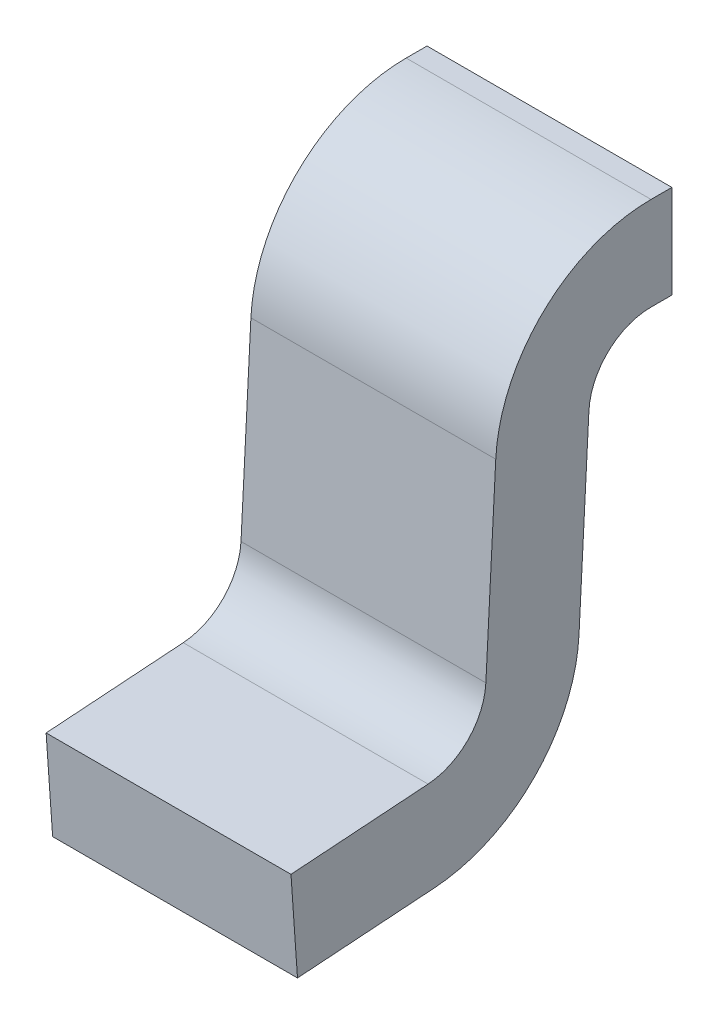
ISO-10303-21;
HEADER;
FILE_DESCRIPTION(('STEP AP214'),'2;1');
FILE_NAME('part.step','',(''),(''),'','','');
FILE_SCHEMA(('AUTOMOTIVE_DESIGN { 1 0 10303 214 1 1 1 1 }'));
ENDSEC;
DATA;
#1=APPLICATION_CONTEXT('core data for automotive mechanical design processes');
#2=APPLICATION_PROTOCOL_DEFINITION('international standard','automotive_design',2000,#1);
#3=PRODUCT_CONTEXT('',#1,'mechanical');
#4=PRODUCT('Part','Part','',(#3));
#5=PRODUCT_RELATED_PRODUCT_CATEGORY('part','',(#4));
#6=PRODUCT_DEFINITION_FORMATION('','',#4);
#7=PRODUCT_DEFINITION_CONTEXT('part definition',#1,'design');
#8=PRODUCT_DEFINITION('design','',#6,#7);
#9=PRODUCT_DEFINITION_SHAPE('','',#8);
#10=(LENGTH_UNIT() NAMED_UNIT(*) SI_UNIT(.MILLI.,.METRE.));
#11=(NAMED_UNIT(*) PLANE_ANGLE_UNIT() SI_UNIT($,.RADIAN.));
#12=(NAMED_UNIT(*) SI_UNIT($,.STERADIAN.) SOLID_ANGLE_UNIT());
#13=UNCERTAINTY_MEASURE_WITH_UNIT(LENGTH_MEASURE(1.E-05),#10,'distance_accuracy_value','');
#14=(GEOMETRIC_REPRESENTATION_CONTEXT(3) GLOBAL_UNCERTAINTY_ASSIGNED_CONTEXT((#13)) GLOBAL_UNIT_ASSIGNED_CONTEXT((#10,
#11,#12)) REPRESENTATION_CONTEXT('',''));
#15=CARTESIAN_POINT('',(0.,0.,0.));
#16=DIRECTION('',(0.,0.,1.));
#17=DIRECTION('',(1.,0.,0.));
#18=AXIS2_PLACEMENT_3D('',#15,#16,#17);
#19=CARTESIAN_POINT('',(0.200025,0.,0.));
#20=DIRECTION('',(1.,0.,0.));
#21=DIRECTION('',(0.,0.,-1.));
#22=AXIS2_PLACEMENT_3D('',#19,#20,#21);
#23=PLANE('',#22);
#24=CARTESIAN_POINT('',(0.200025,0.3556,-0.120375636666));
#25=DIRECTION('',(-1.,0.,0.));
#26=DIRECTION('',(0.,0.,1.));
#27=AXIS2_PLACEMENT_3D('',#24,#25,#26);
#28=CIRCLE('',#27,0.254);
#29=CARTESIAN_POINT('',(0.200025,0.368893332885866,0.133276265161628));
#30=VERTEX_POINT('',#29);
#31=CARTESIAN_POINT('',(0.200025,0.6096,-0.120375636666));
#32=VERTEX_POINT('',#31);
#33=EDGE_CURVE('E196',#30,#32,#28,.T.);
#34=ORIENTED_EDGE('',*,*,#33,.F.);
#35=DIRECTION('',(0.,-0.998629534754575,0.0523359562429177));
#36=VECTOR('',#35,1.);
#37=CARTESIAN_POINT('',(0.200025,0.007975999731426,0.152191141097));
#38=LINE('',#37,#36);
#39=CARTESIAN_POINT('',(0.200025,0.060528969879516,0.149436956636373));
#40=VERTEX_POINT('',#39);
#41=EDGE_CURVE('E193',#40,#30,#38,.F.);
#42=ORIENTED_EDGE('',*,*,#41,.F.);
#43=CARTESIAN_POINT('',(0.200025,0.06584630303378,0.250897717367));
#44=DIRECTION('',(1.,0.,0.));
#45=DIRECTION('',(0.,0.,-1.));
#46=AXIS2_PLACEMENT_3D('',#43,#44,#45);
#47=CIRCLE('',#46,0.1016);
#48=CARTESIAN_POINT('',(0.200025,-0.0355062044726014,0.2438104596348));
#49=VERTEX_POINT('',#48);
#50=EDGE_CURVE('E190',#40,#49,#47,.F.);
#51=ORIENTED_EDGE('',*,*,#50,.T.);
#52=DIRECTION('',(0.,-0.0697564737441177,0.997564050259825));
#53=VECTOR('',#52,1.);
#54=CARTESIAN_POINT('',(0.200025,-0.02923592850034,0.154141335618));
#55=LINE('',#54,#53);
#56=CARTESIAN_POINT('',(0.200025,-0.0511712387403868,0.467830886598001));
#57=VERTEX_POINT('',#56);
#58=EDGE_CURVE('E186',#57,#49,#55,.F.);
#59=ORIENTED_EDGE('',*,*,#58,.F.);
#60=DIRECTION('',(0.,-0.997564050259825,-0.0697564737441177));
#61=VECTOR('',#60,1.);
#62=CARTESIAN_POINT('',(0.200025,-0.0511712387404,0.467830886598));
#63=LINE('',#62,#61);
#64=CARTESIAN_POINT('',(0.200025,-0.203199999999986,0.4571999999998));
#65=VERTEX_POINT('',#64);
#66=EDGE_CURVE('E126',#65,#57,#63,.F.);
#67=ORIENTED_EDGE('',*,*,#66,.F.);
#68=DIRECTION('',(0.,0.0697564737441177,-0.997564050259825));
#69=VECTOR('',#68,1.);
#70=CARTESIAN_POINT('',(0.200025,-0.2032,0.4572));
#71=LINE('',#70,#69);
#72=CARTESIAN_POINT('',(0.200025,-0.1875349657322,0.233179573035991));
#73=VERTEX_POINT('',#72);
#74=EDGE_CURVE('E130',#73,#65,#71,.F.);
#75=ORIENTED_EDGE('',*,*,#74,.F.);
#76=CARTESIAN_POINT('',(0.200025,0.06584630303378,0.250897717367));
#77=DIRECTION('',(-1.,0.,0.));
#78=DIRECTION('',(0.,0.,1.));
#79=AXIS2_PLACEMENT_3D('',#76,#77,#78);
#80=CIRCLE('',#79,0.254);
#81=CARTESIAN_POINT('',(0.200025,0.052552970148079,-0.00275418446043526));
#82=VERTEX_POINT('',#81);
#83=EDGE_CURVE('E174',#82,#73,#80,.T.);
#84=ORIENTED_EDGE('',*,*,#83,.F.);
#85=DIRECTION('',(0.,0.998629534754575,-0.0523359562429177));
#86=VECTOR('',#85,1.);
#87=CARTESIAN_POINT('',(0.200025,-0.171859275802,0.009006762993949));
#88=LINE('',#87,#86);
#89=CARTESIAN_POINT('',(0.200025,0.36091733315414,-0.0189148759351527));
#90=VERTEX_POINT('',#89);
#91=EDGE_CURVE('E90',#90,#82,#88,.F.);
#92=ORIENTED_EDGE('',*,*,#91,.F.);
#93=CARTESIAN_POINT('',(0.200025,0.3556,-0.120375636666));
#94=DIRECTION('',(1.,0.,0.));
#95=DIRECTION('',(0.,0.,-1.));
#96=AXIS2_PLACEMENT_3D('',#93,#94,#95);
#97=CIRCLE('',#96,0.1016);
#98=CARTESIAN_POINT('',(0.200025,0.4572,-0.120375636666));
#99=VERTEX_POINT('',#98);
#100=EDGE_CURVE('E20',#90,#99,#97,.F.);
#101=ORIENTED_EDGE('',*,*,#100,.T.);
#102=DIRECTION('',(0.,0.,-1.));
#103=VECTOR('',#102,1.);
#104=CARTESIAN_POINT('',(0.200025,0.4572,-0.02396083668821));
#105=LINE('',#104,#103);
#106=CARTESIAN_POINT('',(0.200025,0.4572,-0.154469113401));
#107=VERTEX_POINT('',#106);
#108=EDGE_CURVE('E96',#107,#99,#105,.F.);
#109=ORIENTED_EDGE('',*,*,#108,.F.);
#110=DIRECTION('',(0.,1.,0.));
#111=VECTOR('',#110,1.);
#112=CARTESIAN_POINT('',(0.200025,0.4572,-0.154469113401));
#113=LINE('',#112,#111);
#114=CARTESIAN_POINT('',(0.200025,0.6096,-0.154469113401));
#115=VERTEX_POINT('',#114);
#116=EDGE_CURVE('E102',#115,#107,#113,.F.);
#117=ORIENTED_EDGE('',*,*,#116,.F.);
#118=DIRECTION('',(0.,0.,1.));
#119=VECTOR('',#118,1.);
#120=CARTESIAN_POINT('',(0.200025,0.6096,-0.154469113401));
#121=LINE('',#120,#119);
#122=EDGE_CURVE('E108',#32,#115,#121,.F.);
#123=ORIENTED_EDGE('',*,*,#122,.F.);
#124=EDGE_LOOP('',(#34,#42,#51,#59,#67,#75,#84,#92,#101,#109,#117,#123));
#125=FACE_BOUND('',#124,.T.);
#126=ADVANCED_FACE('F17',(#125),#23,.T.);
#127=CARTESIAN_POINT('',(-0.200025,-0.171859275802,0.009006762993949));
#128=DIRECTION('',(0.,-0.0523359562429177,-0.998629534754575));
#129=DIRECTION('',(0.,0.998629534754575,-0.0523359562429177));
#130=AXIS2_PLACEMENT_3D('',#127,#128,#129);
#131=PLANE('',#130);
#132=DIRECTION('',(1.,0.,0.));
#133=VECTOR('',#132,1.);
#134=CARTESIAN_POINT('',(-0.200025,0.360917333154023,-0.0189148759349217));
#135=LINE('',#134,#133);
#136=CARTESIAN_POINT('',(-0.200025,0.360917333154144,-0.0189148759351528));
#137=VERTEX_POINT('',#136);
#138=EDGE_CURVE('E211',#137,#90,#135,.T.);
#139=ORIENTED_EDGE('',*,*,#138,.T.);
#140=ORIENTED_EDGE('',*,*,#91,.T.);
#141=DIRECTION('',(-1.,0.,0.));
#142=VECTOR('',#141,1.);
#143=CARTESIAN_POINT('',(-0.200025,0.0525529701480553,-0.00275418446066082));
#144=LINE('',#143,#142);
#145=CARTESIAN_POINT('',(-0.200025,0.0525529701480712,-0.0027541844604246));
#146=VERTEX_POINT('',#145);
#147=EDGE_CURVE('E172',#146,#82,#144,.F.);
#148=ORIENTED_EDGE('',*,*,#147,.F.);
#149=DIRECTION('',(0.,0.998629534754572,-0.0523359562429831));
#150=VECTOR('',#149,1.);
#151=CARTESIAN_POINT('',(-0.200025,0.05255297014808,-0.002754184460188));
#152=LINE('',#151,#150);
#153=EDGE_CURVE('E169',#146,#137,#152,.T.);
#154=ORIENTED_EDGE('',*,*,#153,.T.);
#155=EDGE_LOOP('',(#139,#140,#148,#154));
#156=FACE_BOUND('',#155,.T.);
#157=ADVANCED_FACE('F257',(#156),#131,.T.);
#158=CARTESIAN_POINT('',(-0.200025,0.3556,-0.120375636666));
#159=DIRECTION('',(1.,0.,0.));
#160=DIRECTION('',(0.,0.,-1.));
#161=AXIS2_PLACEMENT_3D('',#158,#159,#160);
#162=CYLINDRICAL_SURFACE('',#161,0.1016);
#163=ORIENTED_EDGE('',*,*,#138,.F.);
#164=CARTESIAN_POINT('',(-0.200025,0.3556,-0.120375636666));
#165=DIRECTION('',(1.,0.,0.));
#166=DIRECTION('',(0.,0.,-1.));
#167=AXIS2_PLACEMENT_3D('',#164,#165,#166);
#168=CIRCLE('',#167,0.1016);
#169=CARTESIAN_POINT('',(-0.200025,0.4572,-0.120375636666));
#170=VERTEX_POINT('',#169);
#171=EDGE_CURVE('E166',#137,#170,#168,.F.);
#172=ORIENTED_EDGE('',*,*,#171,.T.);
#173=DIRECTION('',(1.,0.,0.));
#174=VECTOR('',#173,1.);
#175=CARTESIAN_POINT('',(-0.200025,0.4572,-0.120375636666));
#176=LINE('',#175,#174);
#177=EDGE_CURVE('E209',#99,#170,#176,.F.);
#178=ORIENTED_EDGE('',*,*,#177,.F.);
#179=ORIENTED_EDGE('',*,*,#100,.F.);
#180=EDGE_LOOP('',(#163,#172,#178,#179));
#181=FACE_BOUND('',#180,.T.);
#182=ADVANCED_FACE('F255',(#181),#162,.F.);
#183=CARTESIAN_POINT('',(-0.200025,0.4572,-0.02396083668821));
#184=DIRECTION('',(0.,-1.,0.));
#185=DIRECTION('',(0.,0.,-1.));
#186=AXIS2_PLACEMENT_3D('',#183,#184,#185);
#187=PLANE('',#186);
#188=ORIENTED_EDGE('',*,*,#177,.T.);
#189=DIRECTION('',(0.,0.,-1.));
#190=VECTOR('',#189,1.);
#191=CARTESIAN_POINT('',(-0.200025,0.4572,0.));
#192=LINE('',#191,#190);
#193=CARTESIAN_POINT('',(-0.200025,0.4572,-0.154469113401));
#194=VERTEX_POINT('',#193);
#195=EDGE_CURVE('E163',#170,#194,#192,.T.);
#196=ORIENTED_EDGE('',*,*,#195,.T.);
#197=DIRECTION('',(-1.,0.,0.));
#198=VECTOR('',#197,1.);
#199=CARTESIAN_POINT('',(-0.200025,0.4572,-0.154469113401));
#200=LINE('',#199,#198);
#201=EDGE_CURVE('E205',#107,#194,#200,.T.);
#202=ORIENTED_EDGE('',*,*,#201,.F.);
#203=ORIENTED_EDGE('',*,*,#108,.T.);
#204=EDGE_LOOP('',(#188,#196,#202,#203));
#205=FACE_BOUND('',#204,.T.);
#206=ADVANCED_FACE('F251',(#205),#187,.T.);
#207=CARTESIAN_POINT('',(-0.200025,0.4572,-0.154469113401));
#208=DIRECTION('',(0.,0.,-1.));
#209=DIRECTION('',(-1.,0.,0.));
#210=AXIS2_PLACEMENT_3D('',#207,#208,#209);
#211=PLANE('',#210);
#212=ORIENTED_EDGE('',*,*,#201,.T.);
#213=DIRECTION('',(0.,1.,0.));
#214=VECTOR('',#213,1.);
#215=CARTESIAN_POINT('',(-0.200025,0.,-0.154469113401));
#216=LINE('',#215,#214);
#217=CARTESIAN_POINT('',(-0.200025,0.6096,-0.154469113401));
#218=VERTEX_POINT('',#217);
#219=EDGE_CURVE('E160',#194,#218,#216,.T.);
#220=ORIENTED_EDGE('',*,*,#219,.T.);
#221=DIRECTION('',(1.,0.,0.));
#222=VECTOR('',#221,1.);
#223=CARTESIAN_POINT('',(-0.200025,0.6096,-0.154469113401));
#224=LINE('',#223,#222);
#225=EDGE_CURVE('E197',#115,#218,#224,.F.);
#226=ORIENTED_EDGE('',*,*,#225,.F.);
#227=ORIENTED_EDGE('',*,*,#116,.T.);
#228=EDGE_LOOP('',(#212,#220,#226,#227));
#229=FACE_BOUND('',#228,.T.);
#230=ADVANCED_FACE('F250',(#229),#211,.T.);
#231=CARTESIAN_POINT('',(-0.200025,0.6096,-0.154469113401));
#232=DIRECTION('',(0.,1.,0.));
#233=DIRECTION('',(0.,0.,1.));
#234=AXIS2_PLACEMENT_3D('',#231,#232,#233);
#235=PLANE('',#234);
#236=ORIENTED_EDGE('',*,*,#225,.T.);
#237=DIRECTION('',(0.,0.,-1.));
#238=VECTOR('',#237,1.);
#239=CARTESIAN_POINT('',(-0.200025,0.6096,0.));
#240=LINE('',#239,#238);
#241=CARTESIAN_POINT('',(-0.200025,0.6096,-0.120375636666));
#242=VERTEX_POINT('',#241);
#243=EDGE_CURVE('E157',#218,#242,#240,.F.);
#244=ORIENTED_EDGE('',*,*,#243,.T.);
#245=DIRECTION('',(-1.,0.,0.));
#246=VECTOR('',#245,1.);
#247=CARTESIAN_POINT('',(-0.200025,0.6096,-0.120375636666));
#248=LINE('',#247,#246);
#249=EDGE_CURVE('E194',#32,#242,#248,.T.);
#250=ORIENTED_EDGE('',*,*,#249,.F.);
#251=ORIENTED_EDGE('',*,*,#122,.T.);
#252=EDGE_LOOP('',(#236,#244,#250,#251));
#253=FACE_BOUND('',#252,.T.);
#254=ADVANCED_FACE('F245',(#253),#235,.T.);
#255=CARTESIAN_POINT('',(-0.200025,0.3556,-0.120375636666));
#256=DIRECTION('',(-1.,0.,0.));
#257=DIRECTION('',(0.,0.,1.));
#258=AXIS2_PLACEMENT_3D('',#255,#256,#257);
#259=CYLINDRICAL_SURFACE('',#258,0.254);
#260=CARTESIAN_POINT('',(-0.200025,0.3556,-0.120375636666));
#261=DIRECTION('',(-1.,0.,0.));
#262=DIRECTION('',(0.,0.,1.));
#263=AXIS2_PLACEMENT_3D('',#260,#261,#262);
#264=CIRCLE('',#263,0.254);
#265=CARTESIAN_POINT('',(-0.200025,0.368893332885771,0.133276265161322));
#266=VERTEX_POINT('',#265);
#267=EDGE_CURVE('E156',#242,#266,#264,.F.);
#268=ORIENTED_EDGE('',*,*,#267,.T.);
#269=DIRECTION('',(1.,0.,0.));
#270=VECTOR('',#269,1.);
#271=CARTESIAN_POINT('',(-0.200025,0.368893332886032,0.133276265161619));
#272=LINE('',#271,#270);
#273=EDGE_CURVE('E191',#30,#266,#272,.F.);
#274=ORIENTED_EDGE('',*,*,#273,.F.);
#275=ORIENTED_EDGE('',*,*,#33,.T.);
#276=ORIENTED_EDGE('',*,*,#249,.T.);
#277=EDGE_LOOP('',(#268,#274,#275,#276));
#278=FACE_BOUND('',#277,.T.);
#279=ADVANCED_FACE('F243',(#278),#259,.T.);
#280=CARTESIAN_POINT('',(-0.200025,0.007975999731426,0.152191141097));
#281=DIRECTION('',(0.,0.0523359562429177,0.998629534754575));
#282=DIRECTION('',(0.,-0.998629534754575,0.0523359562429177));
#283=AXIS2_PLACEMENT_3D('',#280,#281,#282);
#284=PLANE('',#283);
#285=ORIENTED_EDGE('',*,*,#273,.T.);
#286=DIRECTION('',(0.,-0.998629534754608,0.0523359562422955));
#287=VECTOR('',#286,1.);
#288=CARTESIAN_POINT('',(-0.200025,0.368893332886,0.133276265161));
#289=LINE('',#288,#287);
#290=CARTESIAN_POINT('',(-0.200025,0.0605289698795264,0.149436956635966));
#291=VERTEX_POINT('',#290);
#292=EDGE_CURVE('E146',#266,#291,#289,.T.);
#293=ORIENTED_EDGE('',*,*,#292,.T.);
#294=DIRECTION('',(1.,0.,0.));
#295=VECTOR('',#294,1.);
#296=CARTESIAN_POINT('',(-0.200025,0.0605289698794866,0.149436956635936));
#297=LINE('',#296,#295);
#298=EDGE_CURVE('E187',#291,#40,#297,.T.);
#299=ORIENTED_EDGE('',*,*,#298,.T.);
#300=ORIENTED_EDGE('',*,*,#41,.T.);
#301=EDGE_LOOP('',(#285,#293,#299,#300));
#302=FACE_BOUND('',#301,.T.);
#303=ADVANCED_FACE('F266',(#302),#284,.T.);
#304=CARTESIAN_POINT('',(-0.200025,0.06584630303378,0.250897717367));
#305=DIRECTION('',(1.,0.,0.));
#306=DIRECTION('',(0.,0.,-1.));
#307=AXIS2_PLACEMENT_3D('',#304,#305,#306);
#308=CYLINDRICAL_SURFACE('',#307,0.1016);
#309=ORIENTED_EDGE('',*,*,#298,.F.);
#310=CARTESIAN_POINT('',(-0.200025,0.06584630303378,0.250897717367));
#311=DIRECTION('',(1.,0.,0.));
#312=DIRECTION('',(0.,0.,-1.));
#313=AXIS2_PLACEMENT_3D('',#310,#311,#312);
#314=CIRCLE('',#313,0.1016);
#315=CARTESIAN_POINT('',(-0.200025,-0.0355062044726031,0.243810459634792));
#316=VERTEX_POINT('',#315);
#317=EDGE_CURVE('E144',#291,#316,#314,.F.);
#318=ORIENTED_EDGE('',*,*,#317,.T.);
#319=DIRECTION('',(1.,0.,0.));
#320=VECTOR('',#319,1.);
#321=CARTESIAN_POINT('',(-0.200025,-0.0355062044726154,0.243810459635));
#322=LINE('',#321,#320);
#323=EDGE_CURVE('E143',#49,#316,#322,.F.);
#324=ORIENTED_EDGE('',*,*,#323,.F.);
#325=ORIENTED_EDGE('',*,*,#50,.F.);
#326=EDGE_LOOP('',(#309,#318,#324,#325));
#327=FACE_BOUND('',#326,.T.);
#328=ADVANCED_FACE('F264',(#327),#308,.F.);
#329=CARTESIAN_POINT('',(-0.200025,-0.02923592850034,0.154141335618));
#330=DIRECTION('',(0.,0.997564050259825,0.0697564737441177));
#331=DIRECTION('',(0.,-0.0697564737441177,0.997564050259825));
#332=AXIS2_PLACEMENT_3D('',#329,#330,#331);
#333=PLANE('',#332);
#334=ORIENTED_EDGE('',*,*,#323,.T.);
#335=DIRECTION('',(0.,-0.0697564737442733,0.997564050259814));
#336=VECTOR('',#335,1.);
#337=CARTESIAN_POINT('',(-0.200025,-0.03550620447262,0.243810459635));
#338=LINE('',#337,#336);
#339=CARTESIAN_POINT('',(-0.200025,-0.0511712387404,0.467830886598));
#340=VERTEX_POINT('',#339);
#341=EDGE_CURVE('E137',#316,#340,#338,.T.);
#342=ORIENTED_EDGE('',*,*,#341,.T.);
#343=DIRECTION('',(1.,0.,0.));
#344=VECTOR('',#343,1.);
#345=CARTESIAN_POINT('',(-0.200025,-0.0511712387404,0.467830886598));
#346=LINE('',#345,#344);
#347=EDGE_CURVE('E120',#57,#340,#346,.F.);
#348=ORIENTED_EDGE('',*,*,#347,.F.);
#349=ORIENTED_EDGE('',*,*,#58,.T.);
#350=EDGE_LOOP('',(#334,#342,#348,#349));
#351=FACE_BOUND('',#350,.T.);
#352=ADVANCED_FACE('F141',(#351),#333,.T.);
#353=CARTESIAN_POINT('',(-0.200025,-0.0511712387404,0.467830886598));
#354=DIRECTION('',(0.,-0.0697564737441177,0.997564050259825));
#355=DIRECTION('',(0.,-0.997564050259825,-0.0697564737441177));
#356=AXIS2_PLACEMENT_3D('',#353,#354,#355);
#357=PLANE('',#356);
#358=ORIENTED_EDGE('',*,*,#347,.T.);
#359=DIRECTION('',(0.,-0.997564050260101,-0.0697564737401756));
#360=VECTOR('',#359,1.);
#361=CARTESIAN_POINT('',(-0.200025,-0.0511712387404,0.467830886598));
#362=LINE('',#361,#360);
#363=CARTESIAN_POINT('',(-0.200025,-0.2032,0.4572));
#364=VERTEX_POINT('',#363);
#365=EDGE_CURVE('E124',#340,#364,#362,.T.);
#366=ORIENTED_EDGE('',*,*,#365,.T.);
#367=DIRECTION('',(1.,0.,0.));
#368=VECTOR('',#367,1.);
#369=CARTESIAN_POINT('',(-0.200025,-0.2032,0.4572));
#370=LINE('',#369,#368);
#371=EDGE_CURVE('E177',#65,#364,#370,.F.);
#372=ORIENTED_EDGE('',*,*,#371,.F.);
#373=ORIENTED_EDGE('',*,*,#66,.T.);
#374=EDGE_LOOP('',(#358,#366,#372,#373));
#375=FACE_BOUND('',#374,.T.);
#376=ADVANCED_FACE('F122',(#375),#357,.T.);
#377=CARTESIAN_POINT('',(-0.200025,-0.2032,0.4572));
#378=DIRECTION('',(0.,-0.997564050259825,-0.0697564737441177));
#379=DIRECTION('',(0.,0.0697564737441177,-0.997564050259825));
#380=AXIS2_PLACEMENT_3D('',#377,#378,#379);
#381=PLANE('',#380);
#382=ORIENTED_EDGE('',*,*,#371,.T.);
#383=DIRECTION('',(0.,0.0697564737449384,-0.997564050259767));
#384=VECTOR('',#383,1.);
#385=CARTESIAN_POINT('',(-0.200025,-0.2032,0.4572));
#386=LINE('',#385,#384);
#387=CARTESIAN_POINT('',(-0.200025,-0.1875349657321,0.233179573035893));
#388=VERTEX_POINT('',#387);
#389=EDGE_CURVE('E26',#364,#388,#386,.T.);
#390=ORIENTED_EDGE('',*,*,#389,.T.);
#391=DIRECTION('',(-1.,0.,0.));
#392=VECTOR('',#391,1.);
#393=CARTESIAN_POINT('',(-0.200025,-0.187534965732215,0.233179573035985));
#394=LINE('',#393,#392);
#395=EDGE_CURVE('E34',#73,#388,#394,.T.);
#396=ORIENTED_EDGE('',*,*,#395,.F.);
#397=ORIENTED_EDGE('',*,*,#74,.T.);
#398=EDGE_LOOP('',(#382,#390,#396,#397));
#399=FACE_BOUND('',#398,.T.);
#400=ADVANCED_FACE('F260',(#399),#381,.T.);
#401=CARTESIAN_POINT('',(-0.200025,0.06584630303378,0.250897717367));
#402=DIRECTION('',(-1.,0.,0.));
#403=DIRECTION('',(0.,0.,1.));
#404=AXIS2_PLACEMENT_3D('',#401,#402,#403);
#405=CYLINDRICAL_SURFACE('',#404,0.254);
#406=CARTESIAN_POINT('',(-0.200025,0.06584630303378,0.250897717367));
#407=DIRECTION('',(-1.,0.,0.));
#408=DIRECTION('',(0.,0.,1.));
#409=AXIS2_PLACEMENT_3D('',#406,#407,#408);
#410=CIRCLE('',#409,0.254);
#411=EDGE_CURVE('E11',#388,#146,#410,.F.);
#412=ORIENTED_EDGE('',*,*,#411,.T.);
#413=ORIENTED_EDGE('',*,*,#147,.T.);
#414=ORIENTED_EDGE('',*,*,#83,.T.);
#415=ORIENTED_EDGE('',*,*,#395,.T.);
#416=EDGE_LOOP('',(#412,#413,#414,#415));
#417=FACE_BOUND('',#416,.T.);
#418=ADVANCED_FACE('F277',(#417),#405,.T.);
#419=CARTESIAN_POINT('',(-0.200025,0.,0.));
#420=DIRECTION('',(1.,0.,0.));
#421=DIRECTION('',(0.,0.,-1.));
#422=AXIS2_PLACEMENT_3D('',#419,#420,#421);
#423=PLANE('',#422);
#424=ORIENTED_EDGE('',*,*,#389,.F.);
#425=ORIENTED_EDGE('',*,*,#365,.F.);
#426=ORIENTED_EDGE('',*,*,#341,.F.);
#427=ORIENTED_EDGE('',*,*,#317,.F.);
#428=ORIENTED_EDGE('',*,*,#292,.F.);
#429=ORIENTED_EDGE('',*,*,#267,.F.);
#430=ORIENTED_EDGE('',*,*,#243,.F.);
#431=ORIENTED_EDGE('',*,*,#219,.F.);
#432=ORIENTED_EDGE('',*,*,#195,.F.);
#433=ORIENTED_EDGE('',*,*,#171,.F.);
#434=ORIENTED_EDGE('',*,*,#153,.F.);
#435=ORIENTED_EDGE('',*,*,#411,.F.);
#436=EDGE_LOOP('',(#424,#425,#426,#427,#428,#429,#430,#431,#432,#433,#434,#435));
#437=FACE_BOUND('',#436,.T.);
#438=ADVANCED_FACE('F135',(#437),#423,.F.);
#439=CLOSED_SHELL('',(#126,#157,#182,#206,#230,#254,#279,#303,#328,#352,#376,#400,#418,#438));
#440=MANIFOLD_SOLID_BREP('B1',#439);
#441=ADVANCED_BREP_SHAPE_REPRESENTATION('',(#18,#440),#14);
#442=SHAPE_DEFINITION_REPRESENTATION(#9,#441);
ENDSEC;
END-ISO-10303-21;
